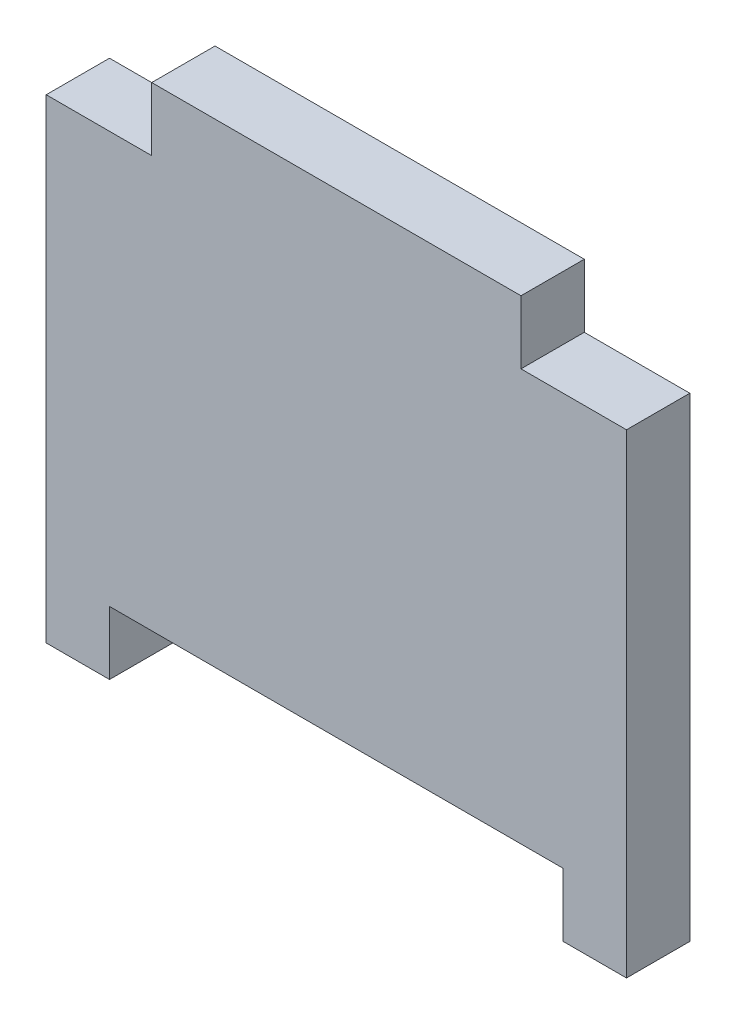
ISO-10303-21;
HEADER;
FILE_DESCRIPTION(('STEP AP214'),'2;1');
FILE_NAME('part.step','',(''),(''),'','','');
FILE_SCHEMA(('AUTOMOTIVE_DESIGN { 1 0 10303 214 1 1 1 1 }'));
ENDSEC;
DATA;
#1=APPLICATION_CONTEXT('core data for automotive mechanical design processes');
#2=APPLICATION_PROTOCOL_DEFINITION('international standard','automotive_design',2000,#1);
#3=PRODUCT_CONTEXT('',#1,'mechanical');
#4=PRODUCT('Part','Part','',(#3));
#5=PRODUCT_RELATED_PRODUCT_CATEGORY('part','',(#4));
#6=PRODUCT_DEFINITION_FORMATION('','',#4);
#7=PRODUCT_DEFINITION_CONTEXT('part definition',#1,'design');
#8=PRODUCT_DEFINITION('design','',#6,#7);
#9=PRODUCT_DEFINITION_SHAPE('','',#8);
#10=(LENGTH_UNIT() NAMED_UNIT(*) SI_UNIT(.MILLI.,.METRE.));
#11=(NAMED_UNIT(*) PLANE_ANGLE_UNIT() SI_UNIT($,.RADIAN.));
#12=(NAMED_UNIT(*) SI_UNIT($,.STERADIAN.) SOLID_ANGLE_UNIT());
#13=UNCERTAINTY_MEASURE_WITH_UNIT(LENGTH_MEASURE(1.E-05),#10,'distance_accuracy_value','');
#14=(GEOMETRIC_REPRESENTATION_CONTEXT(3) GLOBAL_UNCERTAINTY_ASSIGNED_CONTEXT((#13)) GLOBAL_UNIT_ASSIGNED_CONTEXT((#10,
#11,#12)) REPRESENTATION_CONTEXT('',''));
#15=CARTESIAN_POINT('',(0.,0.,0.));
#16=DIRECTION('',(0.,0.,1.));
#17=DIRECTION('',(1.,0.,0.));
#18=AXIS2_PLACEMENT_3D('',#15,#16,#17);
#19=CARTESIAN_POINT('',(-55.,51.,6.));
#20=DIRECTION('',(1.,0.,0.));
#21=DIRECTION('',(0.,1.,0.));
#22=AXIS2_PLACEMENT_3D('',#19,#20,#21);
#23=PLANE('',#22);
#24=DIRECTION('',(0.,-1.,0.));
#25=VECTOR('',#24,1.);
#26=CARTESIAN_POINT('',(-55.,51.,6.));
#27=LINE('',#26,#25);
#28=CARTESIAN_POINT('',(-55.,45.,6.));
#29=VERTEX_POINT('',#28);
#30=CARTESIAN_POINT('',(-55.,0.,6.));
#31=VERTEX_POINT('',#30);
#32=EDGE_CURVE('E136',#29,#31,#27,.T.);
#33=ORIENTED_EDGE('',*,*,#32,.F.);
#34=DIRECTION('',(0.,0.,1.));
#35=VECTOR('',#34,1.);
#36=CARTESIAN_POINT('',(-55.,45.,0.));
#37=LINE('',#36,#35);
#38=CARTESIAN_POINT('',(-55.,45.,0.));
#39=VERTEX_POINT('',#38);
#40=EDGE_CURVE('E124',#39,#29,#37,.T.);
#41=ORIENTED_EDGE('',*,*,#40,.F.);
#42=DIRECTION('',(0.,-1.,0.));
#43=VECTOR('',#42,1.);
#44=CARTESIAN_POINT('',(-55.,51.,0.));
#45=LINE('',#44,#43);
#46=CARTESIAN_POINT('',(-55.,0.,0.));
#47=VERTEX_POINT('',#46);
#48=EDGE_CURVE('E134',#39,#47,#45,.T.);
#49=ORIENTED_EDGE('',*,*,#48,.T.);
#50=DIRECTION('',(0.,0.,-1.));
#51=VECTOR('',#50,1.);
#52=CARTESIAN_POINT('',(-55.,0.,6.));
#53=LINE('',#52,#51);
#54=EDGE_CURVE('E11',#31,#47,#53,.T.);
#55=ORIENTED_EDGE('',*,*,#54,.F.);
#56=EDGE_LOOP('',(#33,#41,#49,#55));
#57=FACE_BOUND('',#56,.T.);
#58=ADVANCED_FACE('F33',(#57),#23,.F.);
#59=CARTESIAN_POINT('',(-55.,0.,6.));
#60=DIRECTION('',(0.,1.,0.));
#61=DIRECTION('',(0.,0.,1.));
#62=AXIS2_PLACEMENT_3D('',#59,#60,#61);
#63=PLANE('',#62);
#64=DIRECTION('',(1.,0.,0.));
#65=VECTOR('',#64,1.);
#66=CARTESIAN_POINT('',(-55.,0.,0.));
#67=LINE('',#66,#65);
#68=CARTESIAN_POINT('',(-49.,0.,0.));
#69=VERTEX_POINT('',#68);
#70=EDGE_CURVE('E140',#47,#69,#67,.T.);
#71=ORIENTED_EDGE('',*,*,#70,.T.);
#72=DIRECTION('',(0.,0.,-1.));
#73=VECTOR('',#72,1.);
#74=CARTESIAN_POINT('',(-49.,0.,6.));
#75=LINE('',#74,#73);
#76=CARTESIAN_POINT('',(-49.,0.,6.));
#77=VERTEX_POINT('',#76);
#78=EDGE_CURVE('E40',#77,#69,#75,.T.);
#79=ORIENTED_EDGE('',*,*,#78,.F.);
#80=DIRECTION('',(1.,0.,0.));
#81=VECTOR('',#80,1.);
#82=CARTESIAN_POINT('',(-55.,0.,6.));
#83=LINE('',#82,#81);
#84=EDGE_CURVE('E241',#31,#77,#83,.T.);
#85=ORIENTED_EDGE('',*,*,#84,.F.);
#86=ORIENTED_EDGE('',*,*,#54,.T.);
#87=EDGE_LOOP('',(#71,#79,#85,#86));
#88=FACE_BOUND('',#87,.T.);
#89=ADVANCED_FACE('F242',(#88),#63,.F.);
#90=CARTESIAN_POINT('',(-49.,0.,6.));
#91=DIRECTION('',(-1.,0.,0.));
#92=DIRECTION('',(0.,0.,1.));
#93=AXIS2_PLACEMENT_3D('',#90,#91,#92);
#94=PLANE('',#93);
#95=DIRECTION('',(0.,1.,0.));
#96=VECTOR('',#95,1.);
#97=CARTESIAN_POINT('',(-49.,0.,0.));
#98=LINE('',#97,#96);
#99=CARTESIAN_POINT('',(-49.,6.,0.));
#100=VERTEX_POINT('',#99);
#101=EDGE_CURVE('E143',#69,#100,#98,.T.);
#102=ORIENTED_EDGE('',*,*,#101,.T.);
#103=DIRECTION('',(0.,0.,-1.));
#104=VECTOR('',#103,1.);
#105=CARTESIAN_POINT('',(-49.,6.,6.));
#106=LINE('',#105,#104);
#107=CARTESIAN_POINT('',(-49.,6.,6.));
#108=VERTEX_POINT('',#107);
#109=EDGE_CURVE('E173',#108,#100,#106,.T.);
#110=ORIENTED_EDGE('',*,*,#109,.F.);
#111=DIRECTION('',(0.,1.,0.));
#112=VECTOR('',#111,1.);
#113=CARTESIAN_POINT('',(-49.,0.,6.));
#114=LINE('',#113,#112);
#115=EDGE_CURVE('E181',#77,#108,#114,.T.);
#116=ORIENTED_EDGE('',*,*,#115,.F.);
#117=ORIENTED_EDGE('',*,*,#78,.T.);
#118=EDGE_LOOP('',(#102,#110,#116,#117));
#119=FACE_BOUND('',#118,.T.);
#120=ADVANCED_FACE('F179',(#119),#94,.F.);
#121=CARTESIAN_POINT('',(-49.,6.,6.));
#122=DIRECTION('',(0.,1.,0.));
#123=DIRECTION('',(0.,0.,1.));
#124=AXIS2_PLACEMENT_3D('',#121,#122,#123);
#125=PLANE('',#124);
#126=DIRECTION('',(1.,0.,0.));
#127=VECTOR('',#126,1.);
#128=CARTESIAN_POINT('',(-49.,6.,0.));
#129=LINE('',#128,#127);
#130=CARTESIAN_POINT('',(-5.99999999999999,6.,0.));
#131=VERTEX_POINT('',#130);
#132=EDGE_CURVE('E152',#100,#131,#129,.T.);
#133=ORIENTED_EDGE('',*,*,#132,.T.);
#134=DIRECTION('',(0.,0.,-1.));
#135=VECTOR('',#134,1.);
#136=CARTESIAN_POINT('',(-5.99999999999999,6.,6.));
#137=LINE('',#136,#135);
#138=CARTESIAN_POINT('',(-5.99999999999999,6.,6.));
#139=VERTEX_POINT('',#138);
#140=EDGE_CURVE('E170',#139,#131,#137,.T.);
#141=ORIENTED_EDGE('',*,*,#140,.F.);
#142=DIRECTION('',(1.,0.,0.));
#143=VECTOR('',#142,1.);
#144=CARTESIAN_POINT('',(-49.,6.,6.));
#145=LINE('',#144,#143);
#146=EDGE_CURVE('E199',#108,#139,#145,.T.);
#147=ORIENTED_EDGE('',*,*,#146,.F.);
#148=ORIENTED_EDGE('',*,*,#109,.T.);
#149=EDGE_LOOP('',(#133,#141,#147,#148));
#150=FACE_BOUND('',#149,.T.);
#151=ADVANCED_FACE('F189',(#150),#125,.F.);
#152=CARTESIAN_POINT('',(-5.99999999999999,0.,6.));
#153=DIRECTION('',(1.,0.,0.));
#154=DIRECTION('',(0.,1.,0.));
#155=AXIS2_PLACEMENT_3D('',#152,#153,#154);
#156=PLANE('',#155);
#157=DIRECTION('',(0.,-1.,0.));
#158=VECTOR('',#157,1.);
#159=CARTESIAN_POINT('',(-5.99999999999999,0.,0.));
#160=LINE('',#159,#158);
#161=CARTESIAN_POINT('',(-5.99999999999999,0.,0.));
#162=VERTEX_POINT('',#161);
#163=EDGE_CURVE('E154',#131,#162,#160,.T.);
#164=ORIENTED_EDGE('',*,*,#163,.T.);
#165=DIRECTION('',(0.,0.,-1.));
#166=VECTOR('',#165,1.);
#167=CARTESIAN_POINT('',(-5.99999999999999,0.,6.));
#168=LINE('',#167,#166);
#169=CARTESIAN_POINT('',(-5.99999999999999,0.,6.));
#170=VERTEX_POINT('',#169);
#171=EDGE_CURVE('E167',#170,#162,#168,.T.);
#172=ORIENTED_EDGE('',*,*,#171,.F.);
#173=DIRECTION('',(0.,-1.,0.));
#174=VECTOR('',#173,1.);
#175=CARTESIAN_POINT('',(-5.99999999999999,0.,6.));
#176=LINE('',#175,#174);
#177=EDGE_CURVE('E195',#139,#170,#176,.T.);
#178=ORIENTED_EDGE('',*,*,#177,.F.);
#179=ORIENTED_EDGE('',*,*,#140,.T.);
#180=EDGE_LOOP('',(#164,#172,#178,#179));
#181=FACE_BOUND('',#180,.T.);
#182=ADVANCED_FACE('F193',(#181),#156,.F.);
#183=CARTESIAN_POINT('',(-5.99999999999999,0.,6.));
#184=DIRECTION('',(0.,1.,0.));
#185=DIRECTION('',(0.,0.,1.));
#186=AXIS2_PLACEMENT_3D('',#183,#184,#185);
#187=PLANE('',#186);
#188=DIRECTION('',(1.,0.,0.));
#189=VECTOR('',#188,1.);
#190=CARTESIAN_POINT('',(-5.99999999999999,0.,0.));
#191=LINE('',#190,#189);
#192=CARTESIAN_POINT('',(0.,0.,0.));
#193=VERTEX_POINT('',#192);
#194=EDGE_CURVE('E156',#162,#193,#191,.T.);
#195=ORIENTED_EDGE('',*,*,#194,.T.);
#196=DIRECTION('',(0.,0.,-1.));
#197=VECTOR('',#196,1.);
#198=CARTESIAN_POINT('',(0.,0.,6.));
#199=LINE('',#198,#197);
#200=CARTESIAN_POINT('',(0.,0.,6.));
#201=VERTEX_POINT('',#200);
#202=EDGE_CURVE('E164',#201,#193,#199,.T.);
#203=ORIENTED_EDGE('',*,*,#202,.F.);
#204=DIRECTION('',(1.,0.,0.));
#205=VECTOR('',#204,1.);
#206=CARTESIAN_POINT('',(-5.99999999999999,0.,6.));
#207=LINE('',#206,#205);
#208=EDGE_CURVE('E198',#170,#201,#207,.T.);
#209=ORIENTED_EDGE('',*,*,#208,.F.);
#210=ORIENTED_EDGE('',*,*,#171,.T.);
#211=EDGE_LOOP('',(#195,#203,#209,#210));
#212=FACE_BOUND('',#211,.T.);
#213=ADVANCED_FACE('F254',(#212),#187,.F.);
#214=CARTESIAN_POINT('',(0.,51.,6.));
#215=DIRECTION('',(-1.,0.,0.));
#216=DIRECTION('',(0.,-1.,0.));
#217=AXIS2_PLACEMENT_3D('',#214,#215,#216);
#218=PLANE('',#217);
#219=DIRECTION('',(0.,1.,0.));
#220=VECTOR('',#219,1.);
#221=CARTESIAN_POINT('',(0.,51.,0.));
#222=LINE('',#221,#220);
#223=CARTESIAN_POINT('',(0.,45.,0.));
#224=VERTEX_POINT('',#223);
#225=EDGE_CURVE('E158',#193,#224,#222,.T.);
#226=ORIENTED_EDGE('',*,*,#225,.T.);
#227=DIRECTION('',(0.,0.,1.));
#228=VECTOR('',#227,1.);
#229=CARTESIAN_POINT('',(0.,45.,0.));
#230=LINE('',#229,#228);
#231=CARTESIAN_POINT('',(0.,45.,6.));
#232=VERTEX_POINT('',#231);
#233=EDGE_CURVE('E226',#224,#232,#230,.T.);
#234=ORIENTED_EDGE('',*,*,#233,.T.);
#235=DIRECTION('',(0.,1.,0.));
#236=VECTOR('',#235,1.);
#237=CARTESIAN_POINT('',(0.,51.,6.));
#238=LINE('',#237,#236);
#239=EDGE_CURVE('E201',#201,#232,#238,.T.);
#240=ORIENTED_EDGE('',*,*,#239,.F.);
#241=ORIENTED_EDGE('',*,*,#202,.T.);
#242=EDGE_LOOP('',(#226,#234,#240,#241));
#243=FACE_BOUND('',#242,.T.);
#244=ADVANCED_FACE('F257',(#243),#218,.F.);
#245=CARTESIAN_POINT('',(-55.,51.,6.));
#246=DIRECTION('',(0.,-1.,0.));
#247=DIRECTION('',(0.,0.,-1.));
#248=AXIS2_PLACEMENT_3D('',#245,#246,#247);
#249=PLANE('',#248);
#250=DIRECTION('',(-1.,0.,0.));
#251=VECTOR('',#250,1.);
#252=CARTESIAN_POINT('',(-55.,51.,0.));
#253=LINE('',#252,#251);
#254=CARTESIAN_POINT('',(-10.,51.,0.));
#255=VERTEX_POINT('',#254);
#256=CARTESIAN_POINT('',(-45.,51.,0.));
#257=VERTEX_POINT('',#256);
#258=EDGE_CURVE('E161',#255,#257,#253,.T.);
#259=ORIENTED_EDGE('',*,*,#258,.T.);
#260=DIRECTION('',(0.,0.,1.));
#261=VECTOR('',#260,1.);
#262=CARTESIAN_POINT('',(-45.,51.,0.));
#263=LINE('',#262,#261);
#264=CARTESIAN_POINT('',(-45.,51.,6.));
#265=VERTEX_POINT('',#264);
#266=EDGE_CURVE('E141',#257,#265,#263,.T.);
#267=ORIENTED_EDGE('',*,*,#266,.T.);
#268=DIRECTION('',(-1.,0.,0.));
#269=VECTOR('',#268,1.);
#270=CARTESIAN_POINT('',(-55.,51.,6.));
#271=LINE('',#270,#269);
#272=CARTESIAN_POINT('',(-10.,51.,6.));
#273=VERTEX_POINT('',#272);
#274=EDGE_CURVE('E148',#273,#265,#271,.T.);
#275=ORIENTED_EDGE('',*,*,#274,.F.);
#276=DIRECTION('',(0.,0.,1.));
#277=VECTOR('',#276,1.);
#278=CARTESIAN_POINT('',(-10.,51.,0.));
#279=LINE('',#278,#277);
#280=EDGE_CURVE('E218',#255,#273,#279,.T.);
#281=ORIENTED_EDGE('',*,*,#280,.F.);
#282=EDGE_LOOP('',(#259,#267,#275,#281));
#283=FACE_BOUND('',#282,.T.);
#284=ADVANCED_FACE('F217',(#283),#249,.F.);
#285=CARTESIAN_POINT('',(0.,0.,6.));
#286=DIRECTION('',(0.,0.,1.));
#287=DIRECTION('',(1.,0.,0.));
#288=AXIS2_PLACEMENT_3D('',#285,#286,#287);
#289=PLANE('',#288);
#290=DIRECTION('',(0.,1.,0.));
#291=VECTOR('',#290,1.);
#292=CARTESIAN_POINT('',(-45.,51.,6.));
#293=LINE('',#292,#291);
#294=CARTESIAN_POINT('',(-45.,45.,6.));
#295=VERTEX_POINT('',#294);
#296=EDGE_CURVE('E129',#295,#265,#293,.T.);
#297=ORIENTED_EDGE('',*,*,#296,.F.);
#298=DIRECTION('',(1.,0.,0.));
#299=VECTOR('',#298,1.);
#300=CARTESIAN_POINT('',(-55.,45.,6.));
#301=LINE('',#300,#299);
#302=EDGE_CURVE('E224',#29,#295,#301,.T.);
#303=ORIENTED_EDGE('',*,*,#302,.F.);
#304=ORIENTED_EDGE('',*,*,#32,.T.);
#305=ORIENTED_EDGE('',*,*,#84,.T.);
#306=ORIENTED_EDGE('',*,*,#115,.T.);
#307=ORIENTED_EDGE('',*,*,#146,.T.);
#308=ORIENTED_EDGE('',*,*,#177,.T.);
#309=ORIENTED_EDGE('',*,*,#208,.T.);
#310=ORIENTED_EDGE('',*,*,#239,.T.);
#311=DIRECTION('',(1.,0.,0.));
#312=VECTOR('',#311,1.);
#313=CARTESIAN_POINT('',(0.,45.,6.));
#314=LINE('',#313,#312);
#315=CARTESIAN_POINT('',(-10.,45.,6.));
#316=VERTEX_POINT('',#315);
#317=EDGE_CURVE('E231',#316,#232,#314,.T.);
#318=ORIENTED_EDGE('',*,*,#317,.F.);
#319=DIRECTION('',(0.,-1.,0.));
#320=VECTOR('',#319,1.);
#321=CARTESIAN_POINT('',(-10.,51.,6.));
#322=LINE('',#321,#320);
#323=EDGE_CURVE('E214',#273,#316,#322,.T.);
#324=ORIENTED_EDGE('',*,*,#323,.F.);
#325=ORIENTED_EDGE('',*,*,#274,.T.);
#326=EDGE_LOOP('',(#297,#303,#304,#305,#306,#307,#308,#309,#310,#318,#324,#325));
#327=FACE_BOUND('',#326,.T.);
#328=ADVANCED_FACE('F212',(#327),#289,.T.);
#329=CARTESIAN_POINT('',(0.,0.,0.));
#330=DIRECTION('',(0.,0.,1.));
#331=DIRECTION('',(1.,0.,0.));
#332=AXIS2_PLACEMENT_3D('',#329,#330,#331);
#333=PLANE('',#332);
#334=DIRECTION('',(1.,0.,0.));
#335=VECTOR('',#334,1.);
#336=CARTESIAN_POINT('',(-55.,45.,0.));
#337=LINE('',#336,#335);
#338=CARTESIAN_POINT('',(-45.,45.,0.));
#339=VERTEX_POINT('',#338);
#340=EDGE_CURVE('E120',#39,#339,#337,.T.);
#341=ORIENTED_EDGE('',*,*,#340,.T.);
#342=DIRECTION('',(0.,1.,0.));
#343=VECTOR('',#342,1.);
#344=CARTESIAN_POINT('',(-45.,51.,0.));
#345=LINE('',#344,#343);
#346=EDGE_CURVE('E47',#339,#257,#345,.T.);
#347=ORIENTED_EDGE('',*,*,#346,.T.);
#348=ORIENTED_EDGE('',*,*,#258,.F.);
#349=DIRECTION('',(0.,-1.,0.));
#350=VECTOR('',#349,1.);
#351=CARTESIAN_POINT('',(-10.,51.,0.));
#352=LINE('',#351,#350);
#353=CARTESIAN_POINT('',(-10.,45.,0.));
#354=VERTEX_POINT('',#353);
#355=EDGE_CURVE('E229',#255,#354,#352,.T.);
#356=ORIENTED_EDGE('',*,*,#355,.T.);
#357=DIRECTION('',(1.,0.,0.));
#358=VECTOR('',#357,1.);
#359=CARTESIAN_POINT('',(0.,45.,0.));
#360=LINE('',#359,#358);
#361=EDGE_CURVE('E55',#354,#224,#360,.T.);
#362=ORIENTED_EDGE('',*,*,#361,.T.);
#363=ORIENTED_EDGE('',*,*,#225,.F.);
#364=ORIENTED_EDGE('',*,*,#194,.F.);
#365=ORIENTED_EDGE('',*,*,#163,.F.);
#366=ORIENTED_EDGE('',*,*,#132,.F.);
#367=ORIENTED_EDGE('',*,*,#101,.F.);
#368=ORIENTED_EDGE('',*,*,#70,.F.);
#369=ORIENTED_EDGE('',*,*,#48,.F.);
#370=EDGE_LOOP('',(#341,#347,#348,#356,#362,#363,#364,#365,#366,#367,#368,#369));
#371=FACE_BOUND('',#370,.T.);
#372=ADVANCED_FACE('F138',(#371),#333,.F.);
#373=CARTESIAN_POINT('',(0.,45.,0.));
#374=DIRECTION('',(0.,-1.,0.));
#375=DIRECTION('',(0.,0.,-1.));
#376=AXIS2_PLACEMENT_3D('',#373,#374,#375);
#377=PLANE('',#376);
#378=ORIENTED_EDGE('',*,*,#317,.T.);
#379=ORIENTED_EDGE('',*,*,#233,.F.);
#380=ORIENTED_EDGE('',*,*,#361,.F.);
#381=DIRECTION('',(0.,0.,1.));
#382=VECTOR('',#381,1.);
#383=CARTESIAN_POINT('',(-10.,45.,0.));
#384=LINE('',#383,#382);
#385=EDGE_CURVE('E237',#354,#316,#384,.T.);
#386=ORIENTED_EDGE('',*,*,#385,.T.);
#387=EDGE_LOOP('',(#378,#379,#380,#386));
#388=FACE_BOUND('',#387,.T.);
#389=ADVANCED_FACE('F266',(#388),#377,.F.);
#390=CARTESIAN_POINT('',(-10.,51.,0.));
#391=DIRECTION('',(-1.,0.,0.));
#392=DIRECTION('',(0.,0.,1.));
#393=AXIS2_PLACEMENT_3D('',#390,#391,#392);
#394=PLANE('',#393);
#395=ORIENTED_EDGE('',*,*,#323,.T.);
#396=ORIENTED_EDGE('',*,*,#385,.F.);
#397=ORIENTED_EDGE('',*,*,#355,.F.);
#398=ORIENTED_EDGE('',*,*,#280,.T.);
#399=EDGE_LOOP('',(#395,#396,#397,#398));
#400=FACE_BOUND('',#399,.T.);
#401=ADVANCED_FACE('F269',(#400),#394,.F.);
#402=CARTESIAN_POINT('',(-45.,51.,0.));
#403=DIRECTION('',(1.,0.,0.));
#404=DIRECTION('',(0.,0.,-1.));
#405=AXIS2_PLACEMENT_3D('',#402,#403,#404);
#406=PLANE('',#405);
#407=ORIENTED_EDGE('',*,*,#296,.T.);
#408=ORIENTED_EDGE('',*,*,#266,.F.);
#409=ORIENTED_EDGE('',*,*,#346,.F.);
#410=DIRECTION('',(0.,0.,1.));
#411=VECTOR('',#410,1.);
#412=CARTESIAN_POINT('',(-45.,45.,0.));
#413=LINE('',#412,#411);
#414=EDGE_CURVE('E126',#339,#295,#413,.T.);
#415=ORIENTED_EDGE('',*,*,#414,.T.);
#416=EDGE_LOOP('',(#407,#408,#409,#415));
#417=FACE_BOUND('',#416,.T.);
#418=ADVANCED_FACE('F220',(#417),#406,.F.);
#419=CARTESIAN_POINT('',(-55.,45.,0.));
#420=DIRECTION('',(0.,-1.,0.));
#421=DIRECTION('',(0.,0.,-1.));
#422=AXIS2_PLACEMENT_3D('',#419,#420,#421);
#423=PLANE('',#422);
#424=ORIENTED_EDGE('',*,*,#302,.T.);
#425=ORIENTED_EDGE('',*,*,#414,.F.);
#426=ORIENTED_EDGE('',*,*,#340,.F.);
#427=ORIENTED_EDGE('',*,*,#40,.T.);
#428=EDGE_LOOP('',(#424,#425,#426,#427));
#429=FACE_BOUND('',#428,.T.);
#430=ADVANCED_FACE('F123',(#429),#423,.F.);
#431=CLOSED_SHELL('',(#58,#89,#120,#151,#182,#213,#244,#284,#328,#372,#389,#401,#418,#430));
#432=MANIFOLD_SOLID_BREP('B2',#431);
#433=ADVANCED_BREP_SHAPE_REPRESENTATION('',(#18,#432),#14);
#434=SHAPE_DEFINITION_REPRESENTATION(#9,#433);
ENDSEC;
END-ISO-10303-21;
